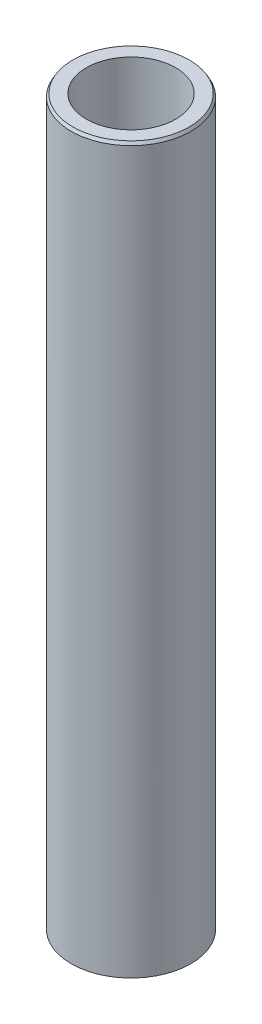
ISO-10303-21;
HEADER;
FILE_DESCRIPTION(('STEP AP214'),'2;1');
FILE_NAME('part.step','',(''),(''),'','','');
FILE_SCHEMA(('AUTOMOTIVE_DESIGN { 1 0 10303 214 1 1 1 1 }'));
ENDSEC;
DATA;
#1=APPLICATION_CONTEXT('core data for automotive mechanical design processes');
#2=APPLICATION_PROTOCOL_DEFINITION('international standard','automotive_design',2000,#1);
#3=PRODUCT_CONTEXT('',#1,'mechanical');
#4=PRODUCT('Part','Part','',(#3));
#5=PRODUCT_RELATED_PRODUCT_CATEGORY('part','',(#4));
#6=PRODUCT_DEFINITION_FORMATION('','',#4);
#7=PRODUCT_DEFINITION_CONTEXT('part definition',#1,'design');
#8=PRODUCT_DEFINITION('design','',#6,#7);
#9=PRODUCT_DEFINITION_SHAPE('','',#8);
#10=(LENGTH_UNIT() NAMED_UNIT(*) SI_UNIT(.MILLI.,.METRE.));
#11=(NAMED_UNIT(*) PLANE_ANGLE_UNIT() SI_UNIT($,.RADIAN.));
#12=(NAMED_UNIT(*) SI_UNIT($,.STERADIAN.) SOLID_ANGLE_UNIT());
#13=UNCERTAINTY_MEASURE_WITH_UNIT(LENGTH_MEASURE(1.E-05),#10,'distance_accuracy_value','');
#14=(GEOMETRIC_REPRESENTATION_CONTEXT(3) GLOBAL_UNCERTAINTY_ASSIGNED_CONTEXT((#13)) GLOBAL_UNIT_ASSIGNED_CONTEXT((#10,
#11,#12)) REPRESENTATION_CONTEXT('',''));
#15=CARTESIAN_POINT('',(0.,0.,0.));
#16=DIRECTION('',(0.,0.,1.));
#17=DIRECTION('',(1.,0.,0.));
#18=AXIS2_PLACEMENT_3D('',#15,#16,#17);
#19=CARTESIAN_POINT('',(0.,333.371668070159,0.));
#20=DIRECTION('',(0.,-1.,0.));
#21=DIRECTION('',(0.,0.,-1.));
#22=AXIS2_PLACEMENT_3D('',#19,#20,#21);
#23=CYLINDRICAL_SURFACE('',#22,27.5);
#24=CARTESIAN_POINT('',(0.,332.017983679924,0.));
#25=DIRECTION('',(0.,1.,0.));
#26=DIRECTION('',(0.,0.,1.));
#27=AXIS2_PLACEMENT_3D('',#24,#25,#26);
#28=CIRCLE('',#27,27.5);
#29=CARTESIAN_POINT('',(0.,332.017983679924,-27.5));
#30=VERTEX_POINT('',#29);
#31=EDGE_CURVE('E50',#30,#30,#28,.F.);
#32=ORIENTED_EDGE('',*,*,#31,.T.);
#33=EDGE_LOOP('',(#32));
#34=FACE_BOUND('',#33,.T.);
#35=CARTESIAN_POINT('',(0.,0.781550047100232,0.));
#36=DIRECTION('',(0.,1.,0.));
#37=DIRECTION('',(0.,0.,1.));
#38=AXIS2_PLACEMENT_3D('',#35,#36,#37);
#39=CIRCLE('',#38,27.5);
#40=CARTESIAN_POINT('',(0.,0.781550047100232,27.5));
#41=VERTEX_POINT('',#40);
#42=EDGE_CURVE('E51',#41,#41,#39,.T.);
#43=ORIENTED_EDGE('',*,*,#42,.T.);
#44=EDGE_LOOP('',(#43));
#45=FACE_BOUND('',#44,.T.);
#46=ADVANCED_FACE('F39',(#34,#45),#23,.T.);
#47=CARTESIAN_POINT('',(0.,333.371668070159,0.));
#48=DIRECTION('',(0.,1.,0.));
#49=DIRECTION('',(0.,0.,1.));
#50=AXIS2_PLACEMENT_3D('',#47,#48,#49);
#51=PLANE('',#50);
#52=CARTESIAN_POINT('',(0.,333.371668070159,0.));
#53=DIRECTION('',(0.,1.,0.));
#54=DIRECTION('',(0.,0.,1.));
#55=AXIS2_PLACEMENT_3D('',#52,#53,#54);
#56=CIRCLE('',#55,26.7184499528998);
#57=CARTESIAN_POINT('',(0.,333.371668070159,-26.7184499528998));
#58=VERTEX_POINT('',#57);
#59=EDGE_CURVE('E54',#58,#58,#56,.T.);
#60=ORIENTED_EDGE('',*,*,#59,.T.);
#61=EDGE_LOOP('',(#60));
#62=FACE_BOUND('',#61,.T.);
#63=CARTESIAN_POINT('',(0.,333.371668070159,0.));
#64=DIRECTION('',(0.,1.,0.));
#65=DIRECTION('',(0.,0.,1.));
#66=AXIS2_PLACEMENT_3D('',#63,#64,#65);
#67=CIRCLE('',#66,20.5275410270387);
#68=CARTESIAN_POINT('',(0.,333.371668070159,20.5275410270387));
#69=VERTEX_POINT('',#68);
#70=EDGE_CURVE('E58',#69,#69,#67,.T.);
#71=ORIENTED_EDGE('',*,*,#70,.F.);
#72=EDGE_LOOP('',(#71));
#73=FACE_BOUND('',#72,.T.);
#74=ADVANCED_FACE('F69',(#62,#73),#51,.T.);
#75=CARTESIAN_POINT('',(0.,0.,0.));
#76=DIRECTION('',(0.,1.,0.));
#77=DIRECTION('',(0.,0.,1.));
#78=AXIS2_PLACEMENT_3D('',#75,#76,#77);
#79=PLANE('',#78);
#80=CARTESIAN_POINT('',(0.,0.,0.));
#81=DIRECTION('',(0.,1.,0.));
#82=DIRECTION('',(0.,0.,1.));
#83=AXIS2_PLACEMENT_3D('',#80,#81,#82);
#84=CIRCLE('',#83,26.1463156097645);
#85=CARTESIAN_POINT('',(0.,0.,26.1463156097645));
#86=VERTEX_POINT('',#85);
#87=EDGE_CURVE('E10',#86,#86,#84,.F.);
#88=ORIENTED_EDGE('',*,*,#87,.T.);
#89=EDGE_LOOP('',(#88));
#90=FACE_BOUND('',#89,.T.);
#91=CARTESIAN_POINT('',(0.,0.,0.));
#92=DIRECTION('',(0.,1.,0.));
#93=DIRECTION('',(0.,0.,1.));
#94=AXIS2_PLACEMENT_3D('',#91,#92,#93);
#95=CIRCLE('',#94,20.5275410270387);
#96=CARTESIAN_POINT('',(0.,0.,20.5275410270387));
#97=VERTEX_POINT('',#96);
#98=EDGE_CURVE('E63',#97,#97,#95,.T.);
#99=ORIENTED_EDGE('',*,*,#98,.T.);
#100=EDGE_LOOP('',(#99));
#101=FACE_BOUND('',#100,.T.);
#102=ADVANCED_FACE('F75',(#90,#101),#79,.F.);
#103=CARTESIAN_POINT('',(0.,333.371668070159,0.));
#104=DIRECTION('',(0.,-1.,0.));
#105=DIRECTION('',(0.,0.,-1.));
#106=AXIS2_PLACEMENT_3D('',#103,#104,#105);
#107=CYLINDRICAL_SURFACE('',#106,20.5275410270387);
#108=ORIENTED_EDGE('',*,*,#70,.T.);
#109=EDGE_LOOP('',(#108));
#110=FACE_BOUND('',#109,.T.);
#111=ORIENTED_EDGE('',*,*,#98,.F.);
#112=EDGE_LOOP('',(#111));
#113=FACE_BOUND('',#112,.T.);
#114=ADVANCED_FACE('F70',(#110,#113),#107,.F.);
#115=CARTESIAN_POINT('',(0.,333.371668070159,0.));
#116=DIRECTION('',(0.,-1.,0.));
#117=DIRECTION('',(0.,0.,-1.));
#118=AXIS2_PLACEMENT_3D('',#115,#116,#117);
#119=CONICAL_SURFACE('',#118,26.7184499528998,0.523598775598312);
#120=CARTESIAN_POINT('',(0.,332.017983679924,-27.5));
#121=CARTESIAN_POINT('',(0.,332.032084558989,-27.4918588536761));
#122=CARTESIAN_POINT('',(0.,332.046185438054,-27.4837177073521));
#123=CARTESIAN_POINT('',(0.,332.074387196183,-27.4674354147042));
#124=CARTESIAN_POINT('',(0.,332.088488075248,-27.4592942683802));
#125=CARTESIAN_POINT('',(0.,332.116689833378,-27.4430119757323));
#126=CARTESIAN_POINT('',(0.,332.130790712443,-27.4348708294083));
#127=CARTESIAN_POINT('',(0.,332.158992470573,-27.4185885367604));
#128=CARTESIAN_POINT('',(0.,332.173093349638,-27.4104473904365));
#129=CARTESIAN_POINT('',(0.,332.201295107768,-27.3941650977885));
#130=CARTESIAN_POINT('',(0.,332.215395986833,-27.3860239514646));
#131=CARTESIAN_POINT('',(0.,332.243597744963,-27.3697416588166));
#132=CARTESIAN_POINT('',(0.,332.257698624028,-27.3616005124927));
#133=CARTESIAN_POINT('',(0.,332.285900382158,-27.3453182198448));
#134=CARTESIAN_POINT('',(0.,332.300001261223,-27.3371770735208));
#135=CARTESIAN_POINT('',(0.,332.328203019353,-27.3208947808729));
#136=CARTESIAN_POINT('',(0.,332.342303898418,-27.3127536345489));
#137=CARTESIAN_POINT('',(0.,332.370505656547,-27.296471341901));
#138=CARTESIAN_POINT('',(0.,332.384606535612,-27.288330195577));
#139=CARTESIAN_POINT('',(0.,332.412808293742,-27.2720479029291));
#140=CARTESIAN_POINT('',(0.,332.426909172807,-27.2639067566052));
#141=CARTESIAN_POINT('',(0.,332.455110930937,-27.2476244639572));
#142=CARTESIAN_POINT('',(0.,332.469211810002,-27.2394833176333));
#143=CARTESIAN_POINT('',(0.,332.497413568132,-27.2232010249854));
#144=CARTESIAN_POINT('',(0.,332.511514447197,-27.2150598786614));
#145=CARTESIAN_POINT('',(0.,332.539716205327,-27.1987775860135));
#146=CARTESIAN_POINT('',(0.,332.553817084392,-27.1906364396895));
#147=CARTESIAN_POINT('',(0.,332.582018842522,-27.1743541470416));
#148=CARTESIAN_POINT('',(0.,332.596119721587,-27.1662130007176));
#149=CARTESIAN_POINT('',(0.,332.624321479717,-27.1499307080697));
#150=CARTESIAN_POINT('',(0.,332.638422358781,-27.1417895617457));
#151=CARTESIAN_POINT('',(0.,332.666624116911,-27.1255072690978));
#152=CARTESIAN_POINT('',(0.,332.680724995976,-27.1173661227739));
#153=CARTESIAN_POINT('',(0.,332.708926754106,-27.1010838301259));
#154=CARTESIAN_POINT('',(0.,332.723027633171,-27.092942683802));
#155=CARTESIAN_POINT('',(0.,332.751229391301,-27.0766603911541));
#156=CARTESIAN_POINT('',(0.,332.765330270366,-27.0685192448301));
#157=CARTESIAN_POINT('',(0.,332.793532028496,-27.0522369521822));
#158=CARTESIAN_POINT('',(0.,332.807632907561,-27.0440958058582));
#159=CARTESIAN_POINT('',(0.,332.835834665691,-27.0278135132103));
#160=CARTESIAN_POINT('',(0.,332.849935544756,-27.0196723668863));
#161=CARTESIAN_POINT('',(0.,332.878137302886,-27.0033900742384));
#162=CARTESIAN_POINT('',(0.,332.892238181951,-26.9952489279144));
#163=CARTESIAN_POINT('',(0.,332.920439940081,-26.9789666352665));
#164=CARTESIAN_POINT('',(0.,332.934540819146,-26.9708254889426));
#165=CARTESIAN_POINT('',(0.,332.962742577275,-26.9545431962946));
#166=CARTESIAN_POINT('',(0.,332.97684345634,-26.9464020499707));
#167=CARTESIAN_POINT('',(0.,333.00504521447,-26.9301197573228));
#168=CARTESIAN_POINT('',(0.,333.019146093535,-26.9219786109988));
#169=CARTESIAN_POINT('',(0.,333.047347851665,-26.9056963183509));
#170=CARTESIAN_POINT('',(0.,333.06144873073,-26.8975551720269));
#171=CARTESIAN_POINT('',(0.,333.08965048886,-26.881272879379));
#172=CARTESIAN_POINT('',(0.,333.103751367925,-26.873131733055));
#173=CARTESIAN_POINT('',(0.,333.131953126055,-26.8568494404071));
#174=CARTESIAN_POINT('',(0.,333.14605400512,-26.8487082940832));
#175=CARTESIAN_POINT('',(0.,333.17425576325,-26.8324260014352));
#176=CARTESIAN_POINT('',(0.,333.188356642315,-26.8242848551113));
#177=CARTESIAN_POINT('',(0.,333.216558400445,-26.8080025624633));
#178=CARTESIAN_POINT('',(0.,333.230659279509,-26.7998614161394));
#179=CARTESIAN_POINT('',(0.,333.258861037639,-26.7835791234915));
#180=CARTESIAN_POINT('',(0.,333.272961916704,-26.7754379771675));
#181=CARTESIAN_POINT('',(0.,333.301163674834,-26.7591556845196));
#182=CARTESIAN_POINT('',(0.,333.315264553899,-26.7510145381956));
#183=CARTESIAN_POINT('',(0.,333.343466312029,-26.7347322455477));
#184=CARTESIAN_POINT('',(0.,333.357567191094,-26.7265910992237));
#185=CARTESIAN_POINT('',(0.,333.371668070159,-26.7184499528998));
#186=B_SPLINE_CURVE_WITH_KNOTS('',3,(#120,#121,#122,#123,#124,#125,#126,#127,#128,#129,#130,
#131,#132,#133,#134,#135,#136,#137,#138,#139,#140,#141,#142,#143,#144,#145,#146,#147,#148,#149,
#150,#151,#152,#153,#154,#155,#156,#157,#158,#159,#160,#161,#162,#163,#164,#165,#166,#167,#168,
#169,#170,#171,#172,#173,#174,#175,#176,#177,#178,#179,#180,#181,#182,#183,#184,#185),
.UNSPECIFIED.,.F.,.F.,(4,2,2,2,2,2,2,2,2,2,2,2,2,2,2,2,2,2,2,2,2,2,2,2,2,2,2,2,2,2,2,2,4),(0.,
0.0488468779438028,0.0976937558875575,0.146540633831312,0.195387511775069,0.244234389718823,
0.293081267662626,0.341928145606381,0.390775023550135,0.43962190149389,0.488468779437645,
0.537315657381448,0.586162535325202,0.635009413268957,0.683856291212712,0.732703169156466,
0.781550047100221,0.830396925044024,0.879243802987778,0.928090680931535,0.976937558875289,
1.02578443681904,1.07463131476285,1.1234781927066,1.17232507065036,1.22117194859411,
1.27001882653787,1.31886570448167,1.36771258242542,1.41655946036918,1.46540633831293,
1.51425321625669,1.56310009420049),.UNSPECIFIED.);
#187=EDGE_CURVE('BSEAM81',#30,#58,#186,.T.);
#188=ORIENTED_EDGE('',*,*,#31,.F.);
#189=ORIENTED_EDGE('',*,*,#59,.F.);
#190=ORIENTED_EDGE('',*,*,#187,.T.);
#191=ORIENTED_EDGE('',*,*,#187,.F.);
#192=EDGE_LOOP('',(#188,#190,#189,#191));
#193=FACE_BOUND('',#192,.T.);
#194=ADVANCED_FACE('F81',(#193),#119,.T.);
#195=CARTESIAN_POINT('',(0.,0.781550047100232,0.));
#196=DIRECTION('',(0.,1.,0.));
#197=DIRECTION('',(0.,0.,1.));
#198=AXIS2_PLACEMENT_3D('',#195,#196,#197);
#199=CONICAL_SURFACE('',#198,27.5,1.04719755119662);
#200=ORIENTED_EDGE('',*,*,#87,.F.);
#201=EDGE_LOOP('',(#200));
#202=FACE_BOUND('',#201,.T.);
#203=ORIENTED_EDGE('',*,*,#42,.F.);
#204=EDGE_LOOP('',(#203));
#205=FACE_BOUND('',#204,.T.);
#206=ADVANCED_FACE('F45',(#202,#205),#199,.T.);
#207=CLOSED_SHELL('',(#46,#74,#102,#114,#194,#206));
#208=MANIFOLD_SOLID_BREP('B2',#207);
#209=ADVANCED_BREP_SHAPE_REPRESENTATION('',(#18,#208),#14);
#210=SHAPE_DEFINITION_REPRESENTATION(#9,#209);
ENDSEC;
END-ISO-10303-21;
